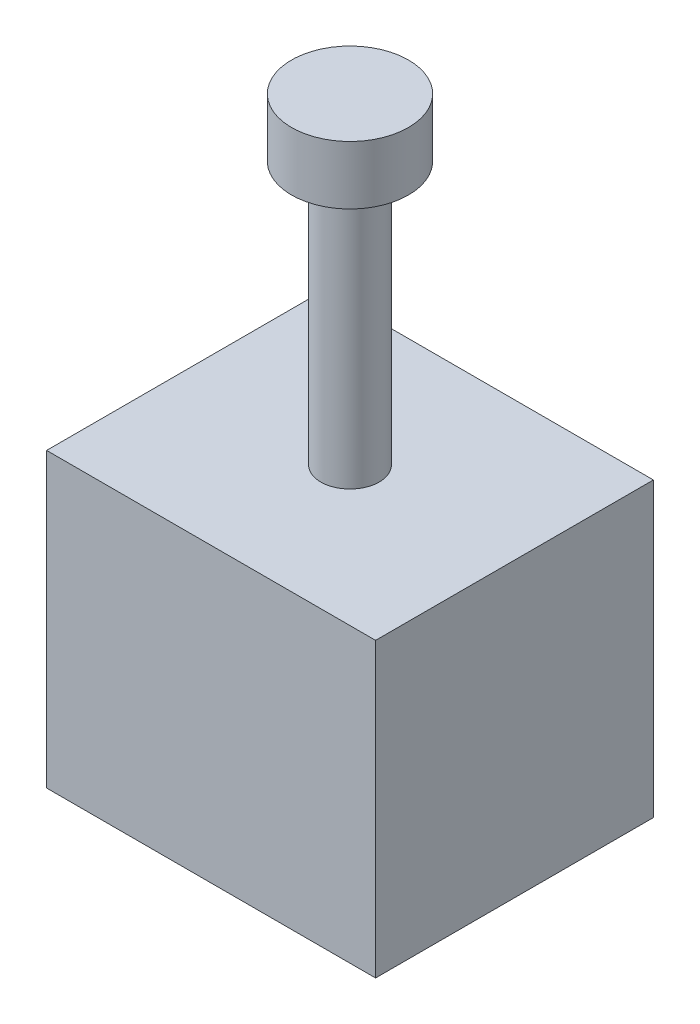
ISO-10303-21;
HEADER;
FILE_DESCRIPTION(('STEP AP214'),'2;1');
FILE_NAME('part.step','',(''),(''),'','','');
FILE_SCHEMA(('AUTOMOTIVE_DESIGN { 1 0 10303 214 1 1 1 1 }'));
ENDSEC;
DATA;
#1=APPLICATION_CONTEXT('core data for automotive mechanical design processes');
#2=APPLICATION_PROTOCOL_DEFINITION('international standard','automotive_design',2000,#1);
#3=PRODUCT_CONTEXT('',#1,'mechanical');
#4=PRODUCT('Part','Part','',(#3));
#5=PRODUCT_RELATED_PRODUCT_CATEGORY('part','',(#4));
#6=PRODUCT_DEFINITION_FORMATION('','',#4);
#7=PRODUCT_DEFINITION_CONTEXT('part definition',#1,'design');
#8=PRODUCT_DEFINITION('design','',#6,#7);
#9=PRODUCT_DEFINITION_SHAPE('','',#8);
#10=(LENGTH_UNIT() NAMED_UNIT(*) SI_UNIT(.MILLI.,.METRE.));
#11=(NAMED_UNIT(*) PLANE_ANGLE_UNIT() SI_UNIT($,.RADIAN.));
#12=(NAMED_UNIT(*) SI_UNIT($,.STERADIAN.) SOLID_ANGLE_UNIT());
#13=UNCERTAINTY_MEASURE_WITH_UNIT(LENGTH_MEASURE(1.E-05),#10,'distance_accuracy_value','');
#14=(GEOMETRIC_REPRESENTATION_CONTEXT(3) GLOBAL_UNCERTAINTY_ASSIGNED_CONTEXT((#13)) GLOBAL_UNIT_ASSIGNED_CONTEXT((#10,
#11,#12)) REPRESENTATION_CONTEXT('',''));
#15=CARTESIAN_POINT('',(0.,0.,0.));
#16=DIRECTION('',(0.,0.,1.));
#17=DIRECTION('',(1.,0.,0.));
#18=AXIS2_PLACEMENT_3D('',#15,#16,#17);
#19=CARTESIAN_POINT('',(-30.6137181996086,-10.,19.2075929549902));
#20=DIRECTION('',(0.,0.,1.));
#21=DIRECTION('',(1.,0.,0.));
#22=AXIS2_PLACEMENT_3D('',#19,#20,#21);
#23=PLANE('',#22);
#24=DIRECTION('',(1.,0.,0.));
#25=VECTOR('',#24,1.);
#26=CARTESIAN_POINT('',(-30.6137181996086,0.,19.2075929549902));
#27=LINE('',#26,#25);
#28=CARTESIAN_POINT('',(-39.3637181996086,0.,19.2075929549902));
#29=VERTEX_POINT('',#28);
#30=CARTESIAN_POINT('',(-28.1137181996086,0.,19.2075929549902));
#31=VERTEX_POINT('',#30);
#32=EDGE_CURVE('E70',#29,#31,#27,.T.);
#33=ORIENTED_EDGE('',*,*,#32,.F.);
#34=DIRECTION('',(0.,1.,0.));
#35=VECTOR('',#34,1.);
#36=CARTESIAN_POINT('',(-39.3637181996086,-10.,19.2075929549902));
#37=LINE('',#36,#35);
#38=CARTESIAN_POINT('',(-39.3637181996086,-10.,19.2075929549902));
#39=VERTEX_POINT('',#38);
#40=EDGE_CURVE('E99',#39,#29,#37,.T.);
#41=ORIENTED_EDGE('',*,*,#40,.F.);
#42=DIRECTION('',(1.,0.,0.));
#43=VECTOR('',#42,1.);
#44=CARTESIAN_POINT('',(-36.8637181996086,-10.,19.2075929549902));
#45=LINE('',#44,#43);
#46=CARTESIAN_POINT('',(-28.1137181996086,-10.,19.2075929549902));
#47=VERTEX_POINT('',#46);
#48=EDGE_CURVE('E32',#39,#47,#45,.T.);
#49=ORIENTED_EDGE('',*,*,#48,.T.);
#50=DIRECTION('',(0.,1.,0.));
#51=VECTOR('',#50,1.);
#52=CARTESIAN_POINT('',(-28.1137181996086,-10.,19.2075929549902));
#53=LINE('',#52,#51);
#54=EDGE_CURVE('E25',#47,#31,#53,.T.);
#55=ORIENTED_EDGE('',*,*,#54,.T.);
#56=EDGE_LOOP('',(#33,#41,#49,#55));
#57=FACE_BOUND('',#56,.T.);
#58=ADVANCED_FACE('F17',(#57),#23,.T.);
#59=CARTESIAN_POINT('',(-28.1137181996086,-10.,12.2075929549902));
#60=DIRECTION('',(1.,0.,0.));
#61=DIRECTION('',(0.,0.,-1.));
#62=AXIS2_PLACEMENT_3D('',#59,#60,#61);
#63=PLANE('',#62);
#64=DIRECTION('',(0.,0.,-1.));
#65=VECTOR('',#64,1.);
#66=CARTESIAN_POINT('',(-28.1137181996086,0.,12.2075929549902));
#67=LINE('',#66,#65);
#68=CARTESIAN_POINT('',(-28.1137181996086,0.,9.70759295499021));
#69=VERTEX_POINT('',#68);
#70=EDGE_CURVE('E61',#31,#69,#67,.T.);
#71=ORIENTED_EDGE('',*,*,#70,.F.);
#72=ORIENTED_EDGE('',*,*,#54,.F.);
#73=DIRECTION('',(0.,0.,-1.));
#74=VECTOR('',#73,1.);
#75=CARTESIAN_POINT('',(-28.1137181996086,-10.,19.2075929549902));
#76=LINE('',#75,#74);
#77=CARTESIAN_POINT('',(-28.1137181996086,-10.,9.70759295499021));
#78=VERTEX_POINT('',#77);
#79=EDGE_CURVE('E93',#47,#78,#76,.T.);
#80=ORIENTED_EDGE('',*,*,#79,.T.);
#81=DIRECTION('',(0.,1.,0.));
#82=VECTOR('',#81,1.);
#83=CARTESIAN_POINT('',(-28.1137181996086,-10.,9.70759295499021));
#84=LINE('',#83,#82);
#85=EDGE_CURVE('E64',#78,#69,#84,.T.);
#86=ORIENTED_EDGE('',*,*,#85,.T.);
#87=EDGE_LOOP('',(#71,#72,#80,#86));
#88=FACE_BOUND('',#87,.T.);
#89=ADVANCED_FACE('F63',(#88),#63,.T.);
#90=CARTESIAN_POINT('',(-36.8637181996086,-10.,9.70759295499021));
#91=DIRECTION('',(0.,0.,-1.));
#92=DIRECTION('',(-1.,0.,0.));
#93=AXIS2_PLACEMENT_3D('',#90,#91,#92);
#94=PLANE('',#93);
#95=DIRECTION('',(-1.,0.,0.));
#96=VECTOR('',#95,1.);
#97=CARTESIAN_POINT('',(-36.8637181996086,0.,9.70759295499021));
#98=LINE('',#97,#96);
#99=CARTESIAN_POINT('',(-39.3637181996086,0.,9.70759295499021));
#100=VERTEX_POINT('',#99);
#101=EDGE_CURVE('E69',#69,#100,#98,.T.);
#102=ORIENTED_EDGE('',*,*,#101,.F.);
#103=ORIENTED_EDGE('',*,*,#85,.F.);
#104=DIRECTION('',(-1.,0.,0.));
#105=VECTOR('',#104,1.);
#106=CARTESIAN_POINT('',(-28.1137181996086,-10.,9.70759295499021));
#107=LINE('',#106,#105);
#108=CARTESIAN_POINT('',(-39.3637181996086,-10.,9.70759295499021));
#109=VERTEX_POINT('',#108);
#110=EDGE_CURVE('E40',#78,#109,#107,.T.);
#111=ORIENTED_EDGE('',*,*,#110,.T.);
#112=DIRECTION('',(0.,1.,0.));
#113=VECTOR('',#112,1.);
#114=CARTESIAN_POINT('',(-39.3637181996086,-10.,9.70759295499021));
#115=LINE('',#114,#113);
#116=EDGE_CURVE('E101',#109,#100,#115,.T.);
#117=ORIENTED_EDGE('',*,*,#116,.T.);
#118=EDGE_LOOP('',(#102,#103,#111,#117));
#119=FACE_BOUND('',#118,.T.);
#120=ADVANCED_FACE('F103',(#119),#94,.T.);
#121=CARTESIAN_POINT('',(-39.3637181996086,-10.,9.70759295499021));
#122=DIRECTION('',(-1.,0.,0.));
#123=DIRECTION('',(0.,0.,1.));
#124=AXIS2_PLACEMENT_3D('',#121,#122,#123);
#125=PLANE('',#124);
#126=DIRECTION('',(0.,0.,1.));
#127=VECTOR('',#126,1.);
#128=CARTESIAN_POINT('',(-39.3637181996086,0.,9.70759295499021));
#129=LINE('',#128,#127);
#130=EDGE_CURVE('E77',#100,#29,#129,.T.);
#131=ORIENTED_EDGE('',*,*,#130,.F.);
#132=ORIENTED_EDGE('',*,*,#116,.F.);
#133=DIRECTION('',(0.,0.,1.));
#134=VECTOR('',#133,1.);
#135=CARTESIAN_POINT('',(-39.3637181996086,-10.,9.70759295499021));
#136=LINE('',#135,#134);
#137=EDGE_CURVE('E96',#109,#39,#136,.T.);
#138=ORIENTED_EDGE('',*,*,#137,.T.);
#139=ORIENTED_EDGE('',*,*,#40,.T.);
#140=EDGE_LOOP('',(#131,#132,#138,#139));
#141=FACE_BOUND('',#140,.T.);
#142=ADVANCED_FACE('F105',(#141),#125,.T.);
#143=CARTESIAN_POINT('',(-28.1137181996086,-10.,19.2075929549902));
#144=DIRECTION('',(0.,1.,0.));
#145=DIRECTION('',(0.,0.,1.));
#146=AXIS2_PLACEMENT_3D('',#143,#144,#145);
#147=PLANE('',#146);
#148=ORIENTED_EDGE('',*,*,#48,.F.);
#149=ORIENTED_EDGE('',*,*,#137,.F.);
#150=ORIENTED_EDGE('',*,*,#110,.F.);
#151=ORIENTED_EDGE('',*,*,#79,.F.);
#152=EDGE_LOOP('',(#148,#149,#150,#151));
#153=FACE_BOUND('',#152,.T.);
#154=ADVANCED_FACE('F106',(#153),#147,.F.);
#155=CARTESIAN_POINT('',(-28.1137181996086,0.,19.2075929549902));
#156=DIRECTION('',(0.,1.,0.));
#157=DIRECTION('',(0.,0.,1.));
#158=AXIS2_PLACEMENT_3D('',#155,#156,#157);
#159=PLANE('',#158);
#160=CARTESIAN_POINT('',(-33.7387181996086,0.,14.4575929549902));
#161=DIRECTION('',(0.,1.,0.));
#162=DIRECTION('',(0.,0.,1.));
#163=AXIS2_PLACEMENT_3D('',#160,#161,#162);
#164=CIRCLE('',#163,1.);
#165=CARTESIAN_POINT('',(-33.7387181996086,0.,15.4575929549902));
#166=VERTEX_POINT('',#165);
#167=EDGE_CURVE('E11',#166,#166,#164,.T.);
#168=ORIENTED_EDGE('',*,*,#167,.F.);
#169=EDGE_LOOP('',(#168));
#170=FACE_BOUND('',#169,.T.);
#171=ORIENTED_EDGE('',*,*,#130,.T.);
#172=ORIENTED_EDGE('',*,*,#32,.T.);
#173=ORIENTED_EDGE('',*,*,#70,.T.);
#174=ORIENTED_EDGE('',*,*,#101,.T.);
#175=EDGE_LOOP('',(#171,#172,#173,#174));
#176=FACE_BOUND('',#175,.T.);
#177=ADVANCED_FACE('F75',(#170,#176),#159,.T.);
#178=CARTESIAN_POINT('',(-33.7387181996086,9.,14.4575929549902));
#179=DIRECTION('',(0.,-1.,0.));
#180=DIRECTION('',(0.,0.,-1.));
#181=AXIS2_PLACEMENT_3D('',#178,#179,#180);
#182=CYLINDRICAL_SURFACE('',#181,1.);
#183=CARTESIAN_POINT('',(-33.7387181996086,9.,14.4575929549902));
#184=DIRECTION('',(0.,-1.,0.));
#185=DIRECTION('',(0.,0.,-1.));
#186=AXIS2_PLACEMENT_3D('',#183,#184,#185);
#187=CIRCLE('',#186,1.);
#188=CARTESIAN_POINT('',(-33.7387181996086,9.,13.4575929549902));
#189=VERTEX_POINT('',#188);
#190=EDGE_CURVE('E79',#189,#189,#187,.F.);
#191=ORIENTED_EDGE('',*,*,#190,.F.);
#192=EDGE_LOOP('',(#191));
#193=FACE_BOUND('',#192,.T.);
#194=ORIENTED_EDGE('',*,*,#167,.T.);
#195=EDGE_LOOP('',(#194));
#196=FACE_BOUND('',#195,.T.);
#197=ADVANCED_FACE('F114',(#193,#196),#182,.T.);
#198=CARTESIAN_POINT('',(-33.7387181996086,11.,14.4575929549902));
#199=DIRECTION('',(0.,-1.,0.));
#200=DIRECTION('',(0.,0.,-1.));
#201=AXIS2_PLACEMENT_3D('',#198,#199,#200);
#202=CYLINDRICAL_SURFACE('',#201,2.);
#203=CARTESIAN_POINT('',(-33.7387181996086,11.,14.4575929549902));
#204=DIRECTION('',(0.,-1.,0.));
#205=DIRECTION('',(1.,0.,0.));
#206=AXIS2_PLACEMENT_3D('',#203,#204,#205);
#207=CIRCLE('',#206,2.);
#208=CARTESIAN_POINT('',(-31.7387181996086,11.,14.4575929549902));
#209=VERTEX_POINT('',#208);
#210=EDGE_CURVE('E84',#209,#209,#207,.T.);
#211=ORIENTED_EDGE('',*,*,#210,.T.);
#212=EDGE_LOOP('',(#211));
#213=FACE_BOUND('',#212,.T.);
#214=CARTESIAN_POINT('',(-33.7387181996086,9.,14.4575929549902));
#215=DIRECTION('',(0.,-1.,0.));
#216=DIRECTION('',(1.,0.,0.));
#217=AXIS2_PLACEMENT_3D('',#214,#215,#216);
#218=CIRCLE('',#217,2.);
#219=CARTESIAN_POINT('',(-31.7387181996086,9.,14.4575929549902));
#220=VERTEX_POINT('',#219);
#221=EDGE_CURVE('E309',#220,#220,#218,.T.);
#222=ORIENTED_EDGE('',*,*,#221,.F.);
#223=EDGE_LOOP('',(#222));
#224=FACE_BOUND('',#223,.T.);
#225=ADVANCED_FACE('F161',(#213,#224),#202,.T.);
#226=CARTESIAN_POINT('',(-33.7387181996086,11.,14.4575929549902));
#227=DIRECTION('',(0.,-1.,0.));
#228=DIRECTION('',(0.,0.,-1.));
#229=AXIS2_PLACEMENT_3D('',#226,#227,#228);
#230=PLANE('',#229);
#231=ORIENTED_EDGE('',*,*,#210,.F.);
#232=EDGE_LOOP('',(#231));
#233=FACE_BOUND('',#232,.T.);
#234=ADVANCED_FACE('F172',(#233),#230,.F.);
#235=CARTESIAN_POINT('',(-33.7387181996086,9.,14.4575929549902));
#236=DIRECTION('',(0.,-1.,0.));
#237=DIRECTION('',(0.,0.,-1.));
#238=AXIS2_PLACEMENT_3D('',#235,#236,#237);
#239=PLANE('',#238);
#240=ORIENTED_EDGE('',*,*,#190,.T.);
#241=EDGE_LOOP('',(#240));
#242=FACE_BOUND('',#241,.T.);
#243=ORIENTED_EDGE('',*,*,#221,.T.);
#244=EDGE_LOOP('',(#243));
#245=FACE_BOUND('',#244,.T.);
#246=ADVANCED_FACE('F183',(#242,#245),#239,.T.);
#247=CLOSED_SHELL('',(#58,#89,#120,#142,#154,#177,#197,#225,#234,#246));
#248=MANIFOLD_SOLID_BREP('B1',#247);
#249=ADVANCED_BREP_SHAPE_REPRESENTATION('',(#18,#248),#14);
#250=SHAPE_DEFINITION_REPRESENTATION(#9,#249);
ENDSEC;
END-ISO-10303-21;
